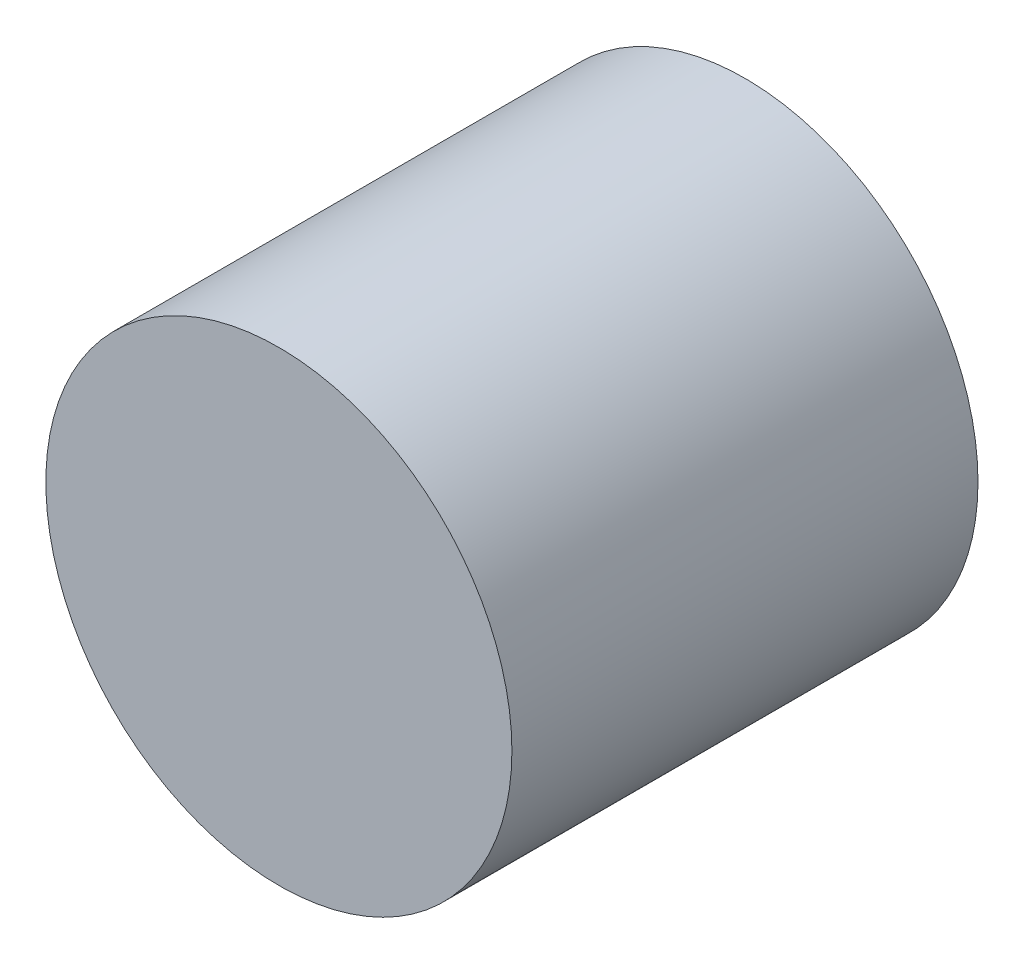
ISO-10303-21;
HEADER;
FILE_DESCRIPTION(('STEP AP214'),'2;1');
FILE_NAME('part.step','',(''),(''),'','','');
FILE_SCHEMA(('AUTOMOTIVE_DESIGN { 1 0 10303 214 1 1 1 1 }'));
ENDSEC;
DATA;
#1=APPLICATION_CONTEXT('core data for automotive mechanical design processes');
#2=APPLICATION_PROTOCOL_DEFINITION('international standard','automotive_design',2000,#1);
#3=PRODUCT_CONTEXT('',#1,'mechanical');
#4=PRODUCT('Part','Part','',(#3));
#5=PRODUCT_RELATED_PRODUCT_CATEGORY('part','',(#4));
#6=PRODUCT_DEFINITION_FORMATION('','',#4);
#7=PRODUCT_DEFINITION_CONTEXT('part definition',#1,'design');
#8=PRODUCT_DEFINITION('design','',#6,#7);
#9=PRODUCT_DEFINITION_SHAPE('','',#8);
#10=(LENGTH_UNIT() NAMED_UNIT(*) SI_UNIT(.MILLI.,.METRE.));
#11=(NAMED_UNIT(*) PLANE_ANGLE_UNIT() SI_UNIT($,.RADIAN.));
#12=(NAMED_UNIT(*) SI_UNIT($,.STERADIAN.) SOLID_ANGLE_UNIT());
#13=UNCERTAINTY_MEASURE_WITH_UNIT(LENGTH_MEASURE(1.E-05),#10,'distance_accuracy_value','');
#14=(GEOMETRIC_REPRESENTATION_CONTEXT(3) GLOBAL_UNCERTAINTY_ASSIGNED_CONTEXT((#13)) GLOBAL_UNIT_ASSIGNED_CONTEXT((#10,
#11,#12)) REPRESENTATION_CONTEXT('',''));
#15=CARTESIAN_POINT('',(0.,0.,0.));
#16=DIRECTION('',(0.,0.,1.));
#17=DIRECTION('',(1.,0.,0.));
#18=AXIS2_PLACEMENT_3D('',#15,#16,#17);
#19=CARTESIAN_POINT('',(0.,0.,6.35));
#20=DIRECTION('',(0.,0.,-1.));
#21=DIRECTION('',(-1.,0.,0.));
#22=AXIS2_PLACEMENT_3D('',#19,#20,#21);
#23=CYLINDRICAL_SURFACE('',#22,3.175);
#24=CARTESIAN_POINT('',(0.,0.,6.35));
#25=DIRECTION('',(0.,0.,1.));
#26=DIRECTION('',(1.,0.,0.));
#27=AXIS2_PLACEMENT_3D('',#24,#25,#26);
#28=CIRCLE('',#27,3.175);
#29=CARTESIAN_POINT('',(3.175,0.,6.35));
#30=VERTEX_POINT('',#29);
#31=EDGE_CURVE('E10',#30,#30,#28,.T.);
#32=ORIENTED_EDGE('',*,*,#31,.F.);
#33=EDGE_LOOP('',(#32));
#34=FACE_BOUND('',#33,.T.);
#35=CARTESIAN_POINT('',(0.,0.,0.));
#36=DIRECTION('',(0.,0.,1.));
#37=DIRECTION('',(1.,0.,0.));
#38=AXIS2_PLACEMENT_3D('',#35,#36,#37);
#39=CIRCLE('',#38,3.175);
#40=CARTESIAN_POINT('',(3.175,0.,0.));
#41=VERTEX_POINT('',#40);
#42=EDGE_CURVE('E34',#41,#41,#39,.T.);
#43=ORIENTED_EDGE('',*,*,#42,.T.);
#44=EDGE_LOOP('',(#43));
#45=FACE_BOUND('',#44,.T.);
#46=ADVANCED_FACE('F31',(#34,#45),#23,.T.);
#47=CARTESIAN_POINT('',(0.,0.,6.35));
#48=DIRECTION('',(0.,0.,1.));
#49=DIRECTION('',(1.,0.,0.));
#50=AXIS2_PLACEMENT_3D('',#47,#48,#49);
#51=PLANE('',#50);
#52=ORIENTED_EDGE('',*,*,#31,.T.);
#53=EDGE_LOOP('',(#52));
#54=FACE_BOUND('',#53,.T.);
#55=ADVANCED_FACE('F46',(#54),#51,.T.);
#56=CARTESIAN_POINT('',(0.,0.,0.));
#57=DIRECTION('',(0.,0.,1.));
#58=DIRECTION('',(1.,0.,0.));
#59=AXIS2_PLACEMENT_3D('',#56,#57,#58);
#60=PLANE('',#59);
#61=ORIENTED_EDGE('',*,*,#42,.F.);
#62=EDGE_LOOP('',(#61));
#63=FACE_BOUND('',#62,.T.);
#64=ADVANCED_FACE('F44',(#63),#60,.F.);
#65=CLOSED_SHELL('',(#46,#55,#64));
#66=MANIFOLD_SOLID_BREP('B2',#65);
#67=ADVANCED_BREP_SHAPE_REPRESENTATION('',(#18,#66),#14);
#68=SHAPE_DEFINITION_REPRESENTATION(#9,#67);
ENDSEC;
END-ISO-10303-21;
